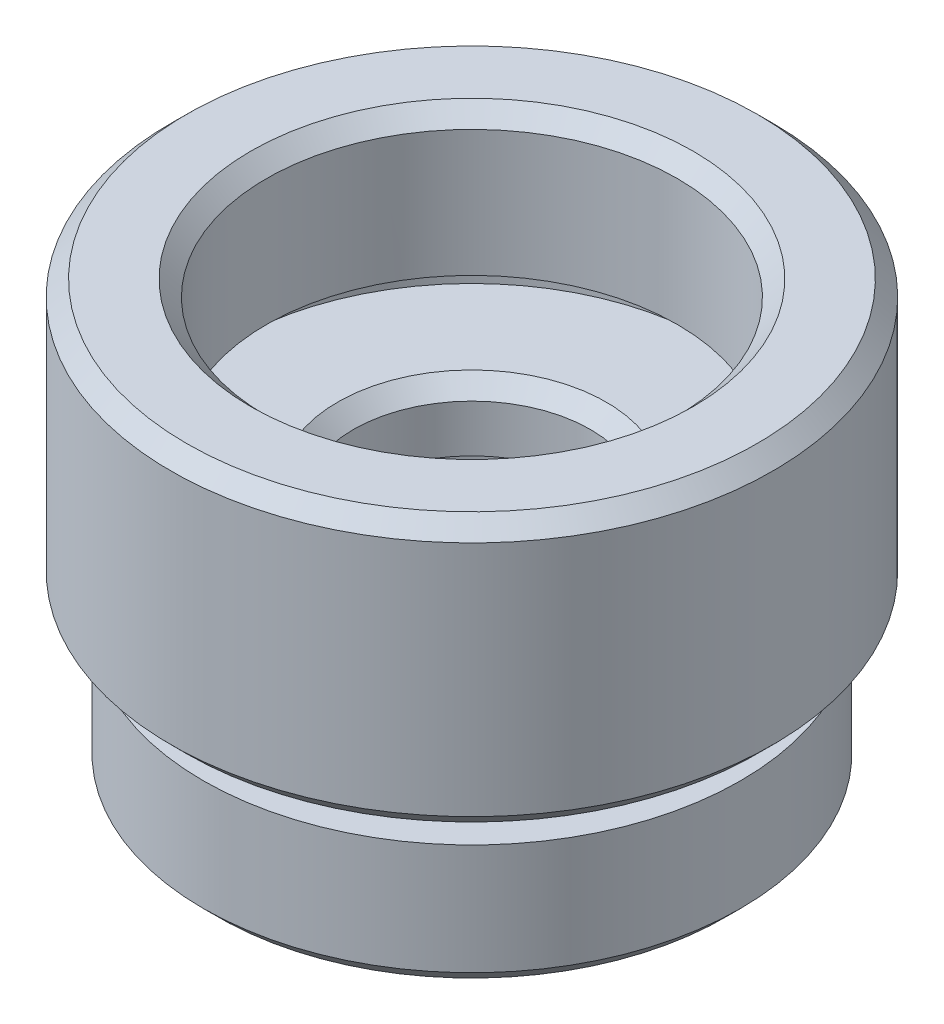
ISO-10303-21;
HEADER;
FILE_DESCRIPTION(('STEP AP214'),'2;1');
FILE_NAME('part.step','',(''),(''),'','','');
FILE_SCHEMA(('AUTOMOTIVE_DESIGN { 1 0 10303 214 1 1 1 1 }'));
ENDSEC;
DATA;
#1=APPLICATION_CONTEXT('core data for automotive mechanical design processes');
#2=APPLICATION_PROTOCOL_DEFINITION('international standard','automotive_design',2000,#1);
#3=PRODUCT_CONTEXT('',#1,'mechanical');
#4=PRODUCT('Part','Part','',(#3));
#5=PRODUCT_RELATED_PRODUCT_CATEGORY('part','',(#4));
#6=PRODUCT_DEFINITION_FORMATION('','',#4);
#7=PRODUCT_DEFINITION_CONTEXT('part definition',#1,'design');
#8=PRODUCT_DEFINITION('design','',#6,#7);
#9=PRODUCT_DEFINITION_SHAPE('','',#8);
#10=(LENGTH_UNIT() NAMED_UNIT(*) SI_UNIT(.MILLI.,.METRE.));
#11=(NAMED_UNIT(*) PLANE_ANGLE_UNIT() SI_UNIT($,.RADIAN.));
#12=(NAMED_UNIT(*) SI_UNIT($,.STERADIAN.) SOLID_ANGLE_UNIT());
#13=UNCERTAINTY_MEASURE_WITH_UNIT(LENGTH_MEASURE(1.E-05),#10,'distance_accuracy_value','');
#14=(GEOMETRIC_REPRESENTATION_CONTEXT(3) GLOBAL_UNCERTAINTY_ASSIGNED_CONTEXT((#13)) GLOBAL_UNIT_ASSIGNED_CONTEXT((#10,
#11,#12)) REPRESENTATION_CONTEXT('',''));
#15=CARTESIAN_POINT('',(0.,0.,0.));
#16=DIRECTION('',(0.,0.,1.));
#17=DIRECTION('',(1.,0.,0.));
#18=AXIS2_PLACEMENT_3D('',#15,#16,#17);
#19=CARTESIAN_POINT('',(6.5,13.5,0.));
#20=DIRECTION('',(0.,1.,0.));
#21=DIRECTION('',(0.,0.,1.));
#22=AXIS2_PLACEMENT_3D('',#19,#20,#21);
#23=PLANE('',#22);
#24=CARTESIAN_POINT('',(0.,13.5,0.));
#25=DIRECTION('',(0.,1.,0.));
#26=DIRECTION('',(0.,0.,1.));
#27=AXIS2_PLACEMENT_3D('',#24,#25,#26);
#28=CIRCLE('',#27,7.);
#29=CARTESIAN_POINT('',(0.,13.5,7.));
#30=VERTEX_POINT('',#29);
#31=EDGE_CURVE('E42',#30,#30,#28,.F.);
#32=ORIENTED_EDGE('',*,*,#31,.T.);
#33=EDGE_LOOP('',(#32));
#34=FACE_BOUND('',#33,.T.);
#35=CARTESIAN_POINT('',(0.,13.5,0.));
#36=DIRECTION('',(0.,-1.,0.));
#37=DIRECTION('',(0.,0.,-1.));
#38=AXIS2_PLACEMENT_3D('',#35,#36,#37);
#39=CIRCLE('',#38,9.025);
#40=CARTESIAN_POINT('',(0.,13.5,-9.025));
#41=VERTEX_POINT('',#40);
#42=EDGE_CURVE('E109',#41,#41,#39,.T.);
#43=ORIENTED_EDGE('',*,*,#42,.F.);
#44=EDGE_LOOP('',(#43));
#45=FACE_BOUND('',#44,.T.);
#46=ADVANCED_FACE('F35',(#34,#45),#23,.T.);
#47=CARTESIAN_POINT('',(0.,0.,0.));
#48=DIRECTION('',(0.,-1.,0.));
#49=DIRECTION('',(0.,0.,-1.));
#50=AXIS2_PLACEMENT_3D('',#47,#48,#49);
#51=CYLINDRICAL_SURFACE('',#50,6.5);
#52=CARTESIAN_POINT('',(0.,13.,0.));
#53=DIRECTION('',(0.,1.,0.));
#54=DIRECTION('',(0.,0.,1.));
#55=AXIS2_PLACEMENT_3D('',#52,#53,#54);
#56=CIRCLE('',#55,6.5);
#57=CARTESIAN_POINT('',(0.,13.,6.5));
#58=VERTEX_POINT('',#57);
#59=EDGE_CURVE('E10',#58,#58,#56,.T.);
#60=ORIENTED_EDGE('',*,*,#59,.T.);
#61=EDGE_LOOP('',(#60));
#62=FACE_BOUND('',#61,.T.);
#63=CARTESIAN_POINT('',(0.,9.,0.));
#64=DIRECTION('',(0.,-1.,0.));
#65=DIRECTION('',(0.,0.,-1.));
#66=AXIS2_PLACEMENT_3D('',#63,#64,#65);
#67=CIRCLE('',#66,6.5);
#68=CARTESIAN_POINT('',(0.,9.,-6.5));
#69=VERTEX_POINT('',#68);
#70=EDGE_CURVE('E55',#69,#69,#67,.T.);
#71=ORIENTED_EDGE('',*,*,#70,.T.);
#72=EDGE_LOOP('',(#71));
#73=FACE_BOUND('',#72,.T.);
#74=ADVANCED_FACE('F117',(#62,#73),#51,.F.);
#75=CARTESIAN_POINT('',(7.6,9.,0.));
#76=DIRECTION('',(0.,-1.,0.));
#77=DIRECTION('',(0.,0.,-1.));
#78=AXIS2_PLACEMENT_3D('',#75,#76,#77);
#79=PLANE('',#78);
#80=CARTESIAN_POINT('',(0.,9.,0.));
#81=DIRECTION('',(0.,-1.,0.));
#82=DIRECTION('',(0.,0.,-1.));
#83=AXIS2_PLACEMENT_3D('',#80,#81,#82);
#84=CIRCLE('',#83,7.6);
#85=CARTESIAN_POINT('',(0.,9.,-7.6));
#86=VERTEX_POINT('',#85);
#87=EDGE_CURVE('E58',#86,#86,#84,.T.);
#88=ORIENTED_EDGE('',*,*,#87,.T.);
#89=EDGE_LOOP('',(#88));
#90=FACE_BOUND('',#89,.T.);
#91=ORIENTED_EDGE('',*,*,#70,.F.);
#92=EDGE_LOOP('',(#91));
#93=FACE_BOUND('',#92,.T.);
#94=ADVANCED_FACE('F122',(#90,#93),#79,.T.);
#95=CARTESIAN_POINT('',(0.,0.,0.));
#96=DIRECTION('',(0.,-1.,0.));
#97=DIRECTION('',(0.,0.,-1.));
#98=AXIS2_PLACEMENT_3D('',#95,#96,#97);
#99=CYLINDRICAL_SURFACE('',#98,7.6);
#100=CARTESIAN_POINT('',(0.,8.,0.));
#101=DIRECTION('',(0.,-1.,0.));
#102=DIRECTION('',(0.,0.,-1.));
#103=AXIS2_PLACEMENT_3D('',#100,#101,#102);
#104=CIRCLE('',#103,7.6);
#105=CARTESIAN_POINT('',(0.,8.,-7.6));
#106=VERTEX_POINT('',#105);
#107=EDGE_CURVE('E61',#106,#106,#104,.T.);
#108=ORIENTED_EDGE('',*,*,#107,.T.);
#109=EDGE_LOOP('',(#108));
#110=FACE_BOUND('',#109,.T.);
#111=ORIENTED_EDGE('',*,*,#87,.F.);
#112=EDGE_LOOP('',(#111));
#113=FACE_BOUND('',#112,.T.);
#114=ADVANCED_FACE('F143',(#110,#113),#99,.F.);
#115=CARTESIAN_POINT('',(3.75,8.,0.));
#116=DIRECTION('',(0.,1.,0.));
#117=DIRECTION('',(0.,0.,1.));
#118=AXIS2_PLACEMENT_3D('',#115,#116,#117);
#119=PLANE('',#118);
#120=CARTESIAN_POINT('',(0.,8.,0.));
#121=DIRECTION('',(0.,1.,0.));
#122=DIRECTION('',(0.,0.,1.));
#123=AXIS2_PLACEMENT_3D('',#120,#121,#122);
#124=CIRCLE('',#123,4.25);
#125=CARTESIAN_POINT('',(0.,8.,4.25));
#126=VERTEX_POINT('',#125);
#127=EDGE_CURVE('E50',#126,#126,#124,.F.);
#128=ORIENTED_EDGE('',*,*,#127,.T.);
#129=EDGE_LOOP('',(#128));
#130=FACE_BOUND('',#129,.T.);
#131=ORIENTED_EDGE('',*,*,#107,.F.);
#132=EDGE_LOOP('',(#131));
#133=FACE_BOUND('',#132,.T.);
#134=ADVANCED_FACE('F139',(#130,#133),#119,.T.);
#135=CARTESIAN_POINT('',(0.,0.,0.));
#136=DIRECTION('',(0.,-1.,0.));
#137=DIRECTION('',(0.,0.,-1.));
#138=AXIS2_PLACEMENT_3D('',#135,#136,#137);
#139=CYLINDRICAL_SURFACE('',#138,3.75);
#140=CARTESIAN_POINT('',(0.,7.5,0.));
#141=DIRECTION('',(0.,1.,0.));
#142=DIRECTION('',(0.,0.,1.));
#143=AXIS2_PLACEMENT_3D('',#140,#141,#142);
#144=CIRCLE('',#143,3.75);
#145=CARTESIAN_POINT('',(0.,7.5,3.75));
#146=VERTEX_POINT('',#145);
#147=EDGE_CURVE('E46',#146,#146,#144,.T.);
#148=ORIENTED_EDGE('',*,*,#147,.T.);
#149=EDGE_LOOP('',(#148));
#150=FACE_BOUND('',#149,.T.);
#151=CARTESIAN_POINT('',(0.,6.,0.));
#152=DIRECTION('',(0.,-1.,0.));
#153=DIRECTION('',(0.,0.,-1.));
#154=AXIS2_PLACEMENT_3D('',#151,#152,#153);
#155=CIRCLE('',#154,3.75);
#156=CARTESIAN_POINT('',(0.,6.,-3.75));
#157=VERTEX_POINT('',#156);
#158=EDGE_CURVE('E64',#157,#157,#155,.T.);
#159=ORIENTED_EDGE('',*,*,#158,.T.);
#160=EDGE_LOOP('',(#159));
#161=FACE_BOUND('',#160,.T.);
#162=ADVANCED_FACE('F142',(#150,#161),#139,.F.);
#163=CARTESIAN_POINT('',(4.85,6.,0.));
#164=DIRECTION('',(0.,-1.,0.));
#165=DIRECTION('',(0.,0.,-1.));
#166=AXIS2_PLACEMENT_3D('',#163,#164,#165);
#167=PLANE('',#166);
#168=CARTESIAN_POINT('',(0.,6.,0.));
#169=DIRECTION('',(0.,-1.,0.));
#170=DIRECTION('',(0.,0.,-1.));
#171=AXIS2_PLACEMENT_3D('',#168,#169,#170);
#172=CIRCLE('',#171,4.85);
#173=CARTESIAN_POINT('',(0.,6.,-4.85));
#174=VERTEX_POINT('',#173);
#175=EDGE_CURVE('E67',#174,#174,#172,.T.);
#176=ORIENTED_EDGE('',*,*,#175,.T.);
#177=EDGE_LOOP('',(#176));
#178=FACE_BOUND('',#177,.T.);
#179=ORIENTED_EDGE('',*,*,#158,.F.);
#180=EDGE_LOOP('',(#179));
#181=FACE_BOUND('',#180,.T.);
#182=ADVANCED_FACE('F161',(#178,#181),#167,.T.);
#183=CARTESIAN_POINT('',(0.,0.,0.));
#184=DIRECTION('',(0.,-1.,0.));
#185=DIRECTION('',(0.,0.,-1.));
#186=AXIS2_PLACEMENT_3D('',#183,#184,#185);
#187=CYLINDRICAL_SURFACE('',#186,4.85);
#188=CARTESIAN_POINT('',(0.,5.,0.));
#189=DIRECTION('',(0.,-1.,0.));
#190=DIRECTION('',(0.,0.,-1.));
#191=AXIS2_PLACEMENT_3D('',#188,#189,#190);
#192=CIRCLE('',#191,4.85);
#193=CARTESIAN_POINT('',(0.,5.,-4.85));
#194=VERTEX_POINT('',#193);
#195=EDGE_CURVE('E70',#194,#194,#192,.T.);
#196=ORIENTED_EDGE('',*,*,#195,.T.);
#197=EDGE_LOOP('',(#196));
#198=FACE_BOUND('',#197,.T.);
#199=ORIENTED_EDGE('',*,*,#175,.F.);
#200=EDGE_LOOP('',(#199));
#201=FACE_BOUND('',#200,.T.);
#202=ADVANCED_FACE('F165',(#198,#201),#187,.F.);
#203=CARTESIAN_POINT('',(3.15,5.,0.));
#204=DIRECTION('',(0.,1.,0.));
#205=DIRECTION('',(0.,0.,1.));
#206=AXIS2_PLACEMENT_3D('',#203,#204,#205);
#207=PLANE('',#206);
#208=CARTESIAN_POINT('',(0.,5.,0.));
#209=DIRECTION('',(0.,-1.,0.));
#210=DIRECTION('',(0.,0.,-1.));
#211=AXIS2_PLACEMENT_3D('',#208,#209,#210);
#212=CIRCLE('',#211,3.15);
#213=CARTESIAN_POINT('',(0.,5.,-3.15));
#214=VERTEX_POINT('',#213);
#215=EDGE_CURVE('E73',#214,#214,#212,.T.);
#216=ORIENTED_EDGE('',*,*,#215,.T.);
#217=EDGE_LOOP('',(#216));
#218=FACE_BOUND('',#217,.T.);
#219=ORIENTED_EDGE('',*,*,#195,.F.);
#220=EDGE_LOOP('',(#219));
#221=FACE_BOUND('',#220,.T.);
#222=ADVANCED_FACE('F169',(#218,#221),#207,.T.);
#223=CARTESIAN_POINT('',(0.,0.,0.));
#224=DIRECTION('',(0.,-1.,0.));
#225=DIRECTION('',(0.,0.,-1.));
#226=AXIS2_PLACEMENT_3D('',#223,#224,#225);
#227=CYLINDRICAL_SURFACE('',#226,3.15);
#228=CARTESIAN_POINT('',(0.,2.,0.));
#229=DIRECTION('',(0.,-1.,0.));
#230=DIRECTION('',(0.,0.,-1.));
#231=AXIS2_PLACEMENT_3D('',#228,#229,#230);
#232=CIRCLE('',#231,3.15);
#233=CARTESIAN_POINT('',(0.,2.,-3.15));
#234=VERTEX_POINT('',#233);
#235=EDGE_CURVE('E76',#234,#234,#232,.T.);
#236=ORIENTED_EDGE('',*,*,#235,.T.);
#237=EDGE_LOOP('',(#236));
#238=FACE_BOUND('',#237,.T.);
#239=ORIENTED_EDGE('',*,*,#215,.F.);
#240=EDGE_LOOP('',(#239));
#241=FACE_BOUND('',#240,.T.);
#242=ADVANCED_FACE('F173',(#238,#241),#227,.F.);
#243=CARTESIAN_POINT('',(2.75,2.,0.));
#244=DIRECTION('',(0.,1.,0.));
#245=DIRECTION('',(0.,0.,1.));
#246=AXIS2_PLACEMENT_3D('',#243,#244,#245);
#247=PLANE('',#246);
#248=CARTESIAN_POINT('',(0.,2.,0.));
#249=DIRECTION('',(0.,-1.,0.));
#250=DIRECTION('',(0.,0.,-1.));
#251=AXIS2_PLACEMENT_3D('',#248,#249,#250);
#252=CIRCLE('',#251,2.75);
#253=CARTESIAN_POINT('',(0.,2.,-2.75));
#254=VERTEX_POINT('',#253);
#255=EDGE_CURVE('E79',#254,#254,#252,.T.);
#256=ORIENTED_EDGE('',*,*,#255,.T.);
#257=EDGE_LOOP('',(#256));
#258=FACE_BOUND('',#257,.T.);
#259=ORIENTED_EDGE('',*,*,#235,.F.);
#260=EDGE_LOOP('',(#259));
#261=FACE_BOUND('',#260,.T.);
#262=ADVANCED_FACE('F177',(#258,#261),#247,.T.);
#263=CARTESIAN_POINT('',(0.,0.,0.));
#264=DIRECTION('',(0.,-1.,0.));
#265=DIRECTION('',(0.,0.,-1.));
#266=AXIS2_PLACEMENT_3D('',#263,#264,#265);
#267=CYLINDRICAL_SURFACE('',#266,2.75);
#268=CARTESIAN_POINT('',(0.,0.,0.));
#269=DIRECTION('',(0.,-1.,0.));
#270=DIRECTION('',(0.,0.,-1.));
#271=AXIS2_PLACEMENT_3D('',#268,#269,#270);
#272=CIRCLE('',#271,2.75);
#273=CARTESIAN_POINT('',(0.,0.,-2.75));
#274=VERTEX_POINT('',#273);
#275=EDGE_CURVE('E82',#274,#274,#272,.T.);
#276=ORIENTED_EDGE('',*,*,#275,.T.);
#277=EDGE_LOOP('',(#276));
#278=FACE_BOUND('',#277,.T.);
#279=ORIENTED_EDGE('',*,*,#255,.F.);
#280=EDGE_LOOP('',(#279));
#281=FACE_BOUND('',#280,.T.);
#282=ADVANCED_FACE('F181',(#278,#281),#267,.F.);
#283=CARTESIAN_POINT('',(2.75,0.,0.));
#284=DIRECTION('',(0.,-1.,0.));
#285=DIRECTION('',(0.,0.,-1.));
#286=AXIS2_PLACEMENT_3D('',#283,#284,#285);
#287=PLANE('',#286);
#288=CARTESIAN_POINT('',(0.,0.,0.));
#289=DIRECTION('',(0.,-1.,0.));
#290=DIRECTION('',(0.,0.,-1.));
#291=AXIS2_PLACEMENT_3D('',#288,#289,#290);
#292=CIRCLE('',#291,8.);
#293=CARTESIAN_POINT('',(0.,0.,-8.));
#294=VERTEX_POINT('',#293);
#295=EDGE_CURVE('E85',#294,#294,#292,.T.);
#296=ORIENTED_EDGE('',*,*,#295,.T.);
#297=EDGE_LOOP('',(#296));
#298=FACE_BOUND('',#297,.T.);
#299=ORIENTED_EDGE('',*,*,#275,.F.);
#300=EDGE_LOOP('',(#299));
#301=FACE_BOUND('',#300,.T.);
#302=ADVANCED_FACE('F185',(#298,#301),#287,.T.);
#303=CARTESIAN_POINT('',(0.,0.,0.));
#304=DIRECTION('',(0.,1.,0.));
#305=DIRECTION('',(0.,0.,1.));
#306=AXIS2_PLACEMENT_3D('',#303,#304,#305);
#307=CONICAL_SURFACE('',#306,8.,0.785398163397451);
#308=CARTESIAN_POINT('',(0.,0.499999999999998,0.));
#309=DIRECTION('',(0.,-1.,0.));
#310=DIRECTION('',(0.,0.,-1.));
#311=AXIS2_PLACEMENT_3D('',#308,#309,#310);
#312=CIRCLE('',#311,8.5);
#313=CARTESIAN_POINT('',(0.,0.499999999999998,-8.5));
#314=VERTEX_POINT('',#313);
#315=EDGE_CURVE('E88',#314,#314,#312,.T.);
#316=ORIENTED_EDGE('',*,*,#315,.T.);
#317=EDGE_LOOP('',(#316));
#318=FACE_BOUND('',#317,.T.);
#319=ORIENTED_EDGE('',*,*,#295,.F.);
#320=EDGE_LOOP('',(#319));
#321=FACE_BOUND('',#320,.T.);
#322=ADVANCED_FACE('F189',(#318,#321),#307,.T.);
#323=CARTESIAN_POINT('',(0.,0.,0.));
#324=DIRECTION('',(0.,-1.,0.));
#325=DIRECTION('',(0.,0.,-1.));
#326=AXIS2_PLACEMENT_3D('',#323,#324,#325);
#327=CYLINDRICAL_SURFACE('',#326,8.5);
#328=CARTESIAN_POINT('',(0.,4.,0.));
#329=DIRECTION('',(0.,-1.,0.));
#330=DIRECTION('',(0.,0.,-1.));
#331=AXIS2_PLACEMENT_3D('',#328,#329,#330);
#332=CIRCLE('',#331,8.5);
#333=CARTESIAN_POINT('',(0.,4.,-8.5));
#334=VERTEX_POINT('',#333);
#335=EDGE_CURVE('E91',#334,#334,#332,.T.);
#336=ORIENTED_EDGE('',*,*,#335,.T.);
#337=EDGE_LOOP('',(#336));
#338=FACE_BOUND('',#337,.T.);
#339=ORIENTED_EDGE('',*,*,#315,.F.);
#340=EDGE_LOOP('',(#339));
#341=FACE_BOUND('',#340,.T.);
#342=ADVANCED_FACE('F193',(#338,#341),#327,.T.);
#343=CARTESIAN_POINT('',(8.5,4.,0.));
#344=DIRECTION('',(0.,1.,0.));
#345=DIRECTION('',(0.,0.,1.));
#346=AXIS2_PLACEMENT_3D('',#343,#344,#345);
#347=PLANE('',#346);
#348=CARTESIAN_POINT('',(0.,4.,0.));
#349=DIRECTION('',(0.,-1.,0.));
#350=DIRECTION('',(0.,0.,-1.));
#351=AXIS2_PLACEMENT_3D('',#348,#349,#350);
#352=CIRCLE('',#351,7.);
#353=CARTESIAN_POINT('',(0.,4.,-7.));
#354=VERTEX_POINT('',#353);
#355=EDGE_CURVE('E94',#354,#354,#352,.T.);
#356=ORIENTED_EDGE('',*,*,#355,.T.);
#357=EDGE_LOOP('',(#356));
#358=FACE_BOUND('',#357,.T.);
#359=ORIENTED_EDGE('',*,*,#335,.F.);
#360=EDGE_LOOP('',(#359));
#361=FACE_BOUND('',#360,.T.);
#362=ADVANCED_FACE('F197',(#358,#361),#347,.T.);
#363=CARTESIAN_POINT('',(0.,0.,0.));
#364=DIRECTION('',(0.,-1.,0.));
#365=DIRECTION('',(0.,0.,-1.));
#366=AXIS2_PLACEMENT_3D('',#363,#364,#365);
#367=CYLINDRICAL_SURFACE('',#366,7.);
#368=CARTESIAN_POINT('',(0.,5.,0.));
#369=DIRECTION('',(0.,-1.,0.));
#370=DIRECTION('',(0.,0.,-1.));
#371=AXIS2_PLACEMENT_3D('',#368,#369,#370);
#372=CIRCLE('',#371,7.);
#373=CARTESIAN_POINT('',(0.,5.,-7.));
#374=VERTEX_POINT('',#373);
#375=EDGE_CURVE('E97',#374,#374,#372,.T.);
#376=ORIENTED_EDGE('',*,*,#375,.T.);
#377=EDGE_LOOP('',(#376));
#378=FACE_BOUND('',#377,.T.);
#379=ORIENTED_EDGE('',*,*,#355,.F.);
#380=EDGE_LOOP('',(#379));
#381=FACE_BOUND('',#380,.T.);
#382=ADVANCED_FACE('F201',(#378,#381),#367,.T.);
#383=CARTESIAN_POINT('',(7.,5.,0.));
#384=DIRECTION('',(0.,-1.,0.));
#385=DIRECTION('',(0.,0.,-1.));
#386=AXIS2_PLACEMENT_3D('',#383,#384,#385);
#387=PLANE('',#386);
#388=CARTESIAN_POINT('',(0.,5.,0.));
#389=DIRECTION('',(0.,-1.,0.));
#390=DIRECTION('',(0.,0.,-1.));
#391=AXIS2_PLACEMENT_3D('',#388,#389,#390);
#392=CIRCLE('',#391,9.025);
#393=CARTESIAN_POINT('',(0.,5.,-9.025));
#394=VERTEX_POINT('',#393);
#395=EDGE_CURVE('E100',#394,#394,#392,.T.);
#396=ORIENTED_EDGE('',*,*,#395,.T.);
#397=EDGE_LOOP('',(#396));
#398=FACE_BOUND('',#397,.T.);
#399=ORIENTED_EDGE('',*,*,#375,.F.);
#400=EDGE_LOOP('',(#399));
#401=FACE_BOUND('',#400,.T.);
#402=ADVANCED_FACE('F205',(#398,#401),#387,.T.);
#403=CARTESIAN_POINT('',(0.,5.,0.));
#404=DIRECTION('',(0.,1.,0.));
#405=DIRECTION('',(0.,0.,1.));
#406=AXIS2_PLACEMENT_3D('',#403,#404,#405);
#407=CONICAL_SURFACE('',#406,9.025,0.785398163397451);
#408=CARTESIAN_POINT('',(0.,5.5,0.));
#409=DIRECTION('',(0.,-1.,0.));
#410=DIRECTION('',(0.,0.,-1.));
#411=AXIS2_PLACEMENT_3D('',#408,#409,#410);
#412=CIRCLE('',#411,9.525);
#413=CARTESIAN_POINT('',(0.,5.5,-9.525));
#414=VERTEX_POINT('',#413);
#415=EDGE_CURVE('E103',#414,#414,#412,.T.);
#416=ORIENTED_EDGE('',*,*,#415,.T.);
#417=EDGE_LOOP('',(#416));
#418=FACE_BOUND('',#417,.T.);
#419=ORIENTED_EDGE('',*,*,#395,.F.);
#420=EDGE_LOOP('',(#419));
#421=FACE_BOUND('',#420,.T.);
#422=ADVANCED_FACE('F209',(#418,#421),#407,.T.);
#423=CARTESIAN_POINT('',(0.,0.,0.));
#424=DIRECTION('',(0.,-1.,0.));
#425=DIRECTION('',(0.,0.,-1.));
#426=AXIS2_PLACEMENT_3D('',#423,#424,#425);
#427=CYLINDRICAL_SURFACE('',#426,9.525);
#428=CARTESIAN_POINT('',(0.,13.,0.));
#429=DIRECTION('',(0.,-1.,0.));
#430=DIRECTION('',(0.,0.,-1.));
#431=AXIS2_PLACEMENT_3D('',#428,#429,#430);
#432=CIRCLE('',#431,9.525);
#433=CARTESIAN_POINT('',(0.,13.,-9.525));
#434=VERTEX_POINT('',#433);
#435=EDGE_CURVE('E106',#434,#434,#432,.T.);
#436=ORIENTED_EDGE('',*,*,#435,.T.);
#437=EDGE_LOOP('',(#436));
#438=FACE_BOUND('',#437,.T.);
#439=ORIENTED_EDGE('',*,*,#415,.F.);
#440=EDGE_LOOP('',(#439));
#441=FACE_BOUND('',#440,.T.);
#442=ADVANCED_FACE('F133',(#438,#441),#427,.T.);
#443=CARTESIAN_POINT('',(0.,13.,0.));
#444=DIRECTION('',(0.,-1.,0.));
#445=DIRECTION('',(0.,0.,-1.));
#446=AXIS2_PLACEMENT_3D('',#443,#444,#445);
#447=CONICAL_SURFACE('',#446,9.525,0.785398163397445);
#448=ORIENTED_EDGE('',*,*,#42,.T.);
#449=EDGE_LOOP('',(#448));
#450=FACE_BOUND('',#449,.T.);
#451=ORIENTED_EDGE('',*,*,#435,.F.);
#452=EDGE_LOOP('',(#451));
#453=FACE_BOUND('',#452,.T.);
#454=ADVANCED_FACE('F113',(#450,#453),#447,.T.);
#455=CARTESIAN_POINT('',(0.,8.,0.));
#456=DIRECTION('',(0.,1.,0.));
#457=DIRECTION('',(0.,0.,1.));
#458=AXIS2_PLACEMENT_3D('',#455,#456,#457);
#459=CONICAL_SURFACE('',#458,4.25,0.785398163397447);
#460=ORIENTED_EDGE('',*,*,#147,.F.);
#461=EDGE_LOOP('',(#460));
#462=FACE_BOUND('',#461,.T.);
#463=ORIENTED_EDGE('',*,*,#127,.F.);
#464=EDGE_LOOP('',(#463));
#465=FACE_BOUND('',#464,.T.);
#466=ADVANCED_FACE('F125',(#462,#465),#459,.F.);
#467=CARTESIAN_POINT('',(0.,13.5,0.));
#468=DIRECTION('',(0.,1.,0.));
#469=DIRECTION('',(0.,0.,1.));
#470=AXIS2_PLACEMENT_3D('',#467,#468,#469);
#471=CONICAL_SURFACE('',#470,7.,0.785398163397444);
#472=ORIENTED_EDGE('',*,*,#59,.F.);
#473=EDGE_LOOP('',(#472));
#474=FACE_BOUND('',#473,.T.);
#475=ORIENTED_EDGE('',*,*,#31,.F.);
#476=EDGE_LOOP('',(#475));
#477=FACE_BOUND('',#476,.T.);
#478=ADVANCED_FACE('F37',(#474,#477),#471,.F.);
#479=CLOSED_SHELL('',(#46,#74,#94,#114,#134,#162,#182,#202,#222,#242,#262,#282,#302,#322,#342,
#362,#382,#402,#422,#442,#454,#466,#478));
#480=MANIFOLD_SOLID_BREP('B2',#479);
#481=ADVANCED_BREP_SHAPE_REPRESENTATION('',(#18,#480),#14);
#482=SHAPE_DEFINITION_REPRESENTATION(#9,#481);
ENDSEC;
END-ISO-10303-21;
